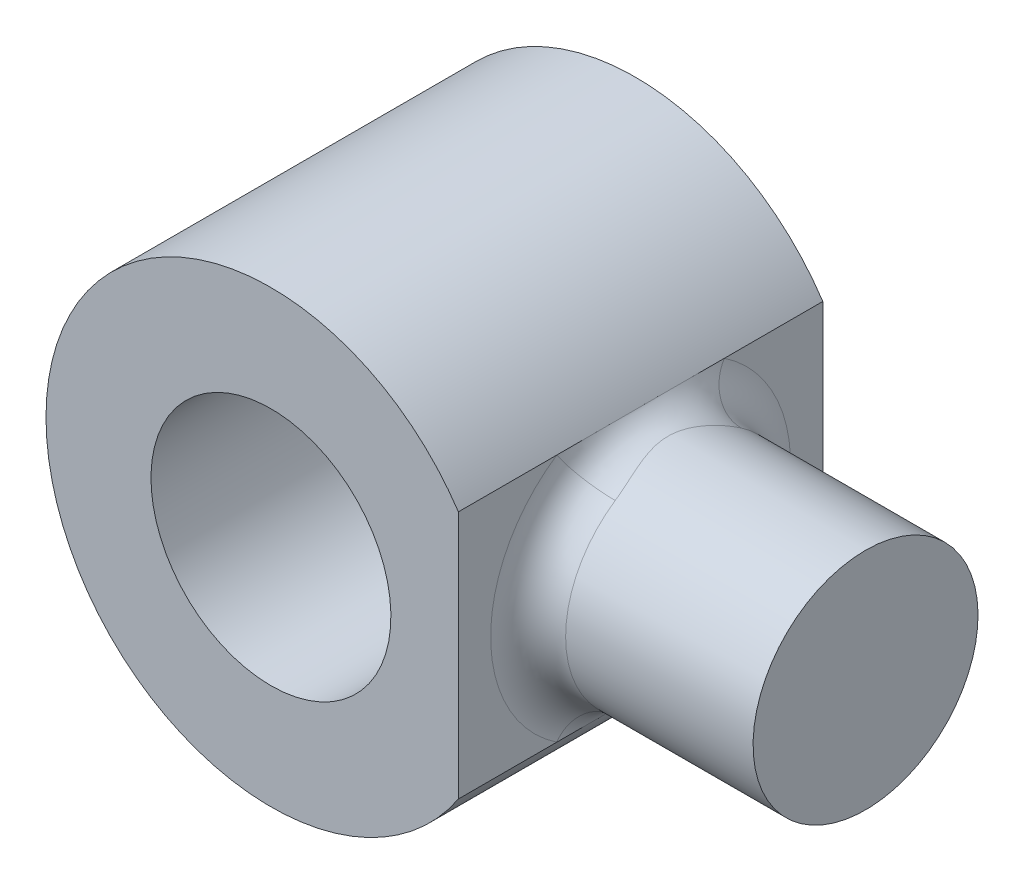
ISO-10303-21;
HEADER;
FILE_DESCRIPTION(('STEP AP214'),'2;1');
FILE_NAME('part.step','',(''),(''),'','','');
FILE_SCHEMA(('AUTOMOTIVE_DESIGN { 1 0 10303 214 1 1 1 1 }'));
ENDSEC;
DATA;
#1=APPLICATION_CONTEXT('core data for automotive mechanical design processes');
#2=APPLICATION_PROTOCOL_DEFINITION('international standard','automotive_design',2000,#1);
#3=PRODUCT_CONTEXT('',#1,'mechanical');
#4=PRODUCT('Part','Part','',(#3));
#5=PRODUCT_RELATED_PRODUCT_CATEGORY('part','',(#4));
#6=PRODUCT_DEFINITION_FORMATION('','',#4);
#7=PRODUCT_DEFINITION_CONTEXT('part definition',#1,'design');
#8=PRODUCT_DEFINITION('design','',#6,#7);
#9=PRODUCT_DEFINITION_SHAPE('','',#8);
#10=(LENGTH_UNIT() NAMED_UNIT(*) SI_UNIT(.MILLI.,.METRE.));
#11=(NAMED_UNIT(*) PLANE_ANGLE_UNIT() SI_UNIT($,.RADIAN.));
#12=(NAMED_UNIT(*) SI_UNIT($,.STERADIAN.) SOLID_ANGLE_UNIT());
#13=UNCERTAINTY_MEASURE_WITH_UNIT(LENGTH_MEASURE(1.E-05),#10,'distance_accuracy_value','');
#14=(GEOMETRIC_REPRESENTATION_CONTEXT(3) GLOBAL_UNCERTAINTY_ASSIGNED_CONTEXT((#13)) GLOBAL_UNIT_ASSIGNED_CONTEXT((#10,
#11,#12)) REPRESENTATION_CONTEXT('',''));
#15=CARTESIAN_POINT('',(0.,0.,0.));
#16=DIRECTION('',(0.,0.,1.));
#17=DIRECTION('',(1.,0.,0.));
#18=AXIS2_PLACEMENT_3D('',#15,#16,#17);
#19=CARTESIAN_POINT('',(15.04125,-1.5166876048223,-10.7694102980499));
#20=DIRECTION('',(1.,0.,0.));
#21=DIRECTION('',(0.,1.,0.));
#22=AXIS2_PLACEMENT_3D('',#19,#20,#21);
#23=PLANE('',#22);
#24=DIRECTION('',(0.,0.,1.));
#25=VECTOR('',#24,1.);
#26=CARTESIAN_POINT('',(15.04125,-1.5166876048223,-10.7694102980499));
#27=LINE('',#26,#25);
#28=CARTESIAN_POINT('',(15.04125,-1.5166876048223,-2.43));
#29=VERTEX_POINT('',#28);
#30=CARTESIAN_POINT('',(15.04125,-1.5166876048223,-1.1180339887499));
#31=VERTEX_POINT('',#30);
#32=EDGE_CURVE('E108',#29,#31,#27,.T.);
#33=ORIENTED_EDGE('',*,*,#32,.T.);
#34=CARTESIAN_POINT('',(15.04125,-3.175,0.));
#35=DIRECTION('',(1.,0.,0.));
#36=DIRECTION('',(0.,1.,0.));
#37=AXIS2_PLACEMENT_3D('',#34,#35,#36);
#38=CIRCLE('',#37,2.);
#39=CARTESIAN_POINT('',(15.04125,-4.8333123951777,-1.1180339887499));
#40=VERTEX_POINT('',#39);
#41=EDGE_CURVE('E12',#31,#40,#38,.F.);
#42=ORIENTED_EDGE('',*,*,#41,.T.);
#43=DIRECTION('',(0.,0.,1.));
#44=VECTOR('',#43,1.);
#45=CARTESIAN_POINT('',(15.04125,-4.8333123951777,-10.7694102980499));
#46=LINE('',#45,#44);
#47=CARTESIAN_POINT('',(15.04125,-4.8333123951777,-2.43));
#48=VERTEX_POINT('',#47);
#49=EDGE_CURVE('E106',#48,#40,#46,.T.);
#50=ORIENTED_EDGE('',*,*,#49,.F.);
#51=DIRECTION('',(0.,-1.,0.));
#52=VECTOR('',#51,1.);
#53=CARTESIAN_POINT('',(15.04125,-1.5166876048223,-2.43));
#54=LINE('',#53,#52);
#55=EDGE_CURVE('E122',#29,#48,#54,.T.);
#56=ORIENTED_EDGE('',*,*,#55,.F.);
#57=EDGE_LOOP('',(#33,#42,#50,#56));
#58=FACE_BOUND('',#57,.T.);
#59=ADVANCED_FACE('F38',(#58),#23,.T.);
#60=CARTESIAN_POINT('',(15.04125,-4.8333123951777,1.11803398874989));
#61=VERTEX_POINT('',#60);
#62=CARTESIAN_POINT('',(15.04125,-4.8333123951777,2.43));
#63=VERTEX_POINT('',#62);
#64=EDGE_CURVE('E59',#61,#63,#46,.T.);
#65=ORIENTED_EDGE('',*,*,#64,.F.);
#66=CARTESIAN_POINT('',(15.04125,-3.175,0.));
#67=DIRECTION('',(1.,0.,0.));
#68=DIRECTION('',(0.,1.,0.));
#69=AXIS2_PLACEMENT_3D('',#66,#67,#68);
#70=CIRCLE('',#69,2.);
#71=CARTESIAN_POINT('',(15.04125,-1.5166876048223,1.1180339887499));
#72=VERTEX_POINT('',#71);
#73=EDGE_CURVE('E51',#61,#72,#70,.F.);
#74=ORIENTED_EDGE('',*,*,#73,.T.);
#75=CARTESIAN_POINT('',(15.04125,-1.5166876048223,2.43));
#76=VERTEX_POINT('',#75);
#77=EDGE_CURVE('E95',#72,#76,#27,.T.);
#78=ORIENTED_EDGE('',*,*,#77,.T.);
#79=DIRECTION('',(0.,1.,0.));
#80=VECTOR('',#79,1.);
#81=CARTESIAN_POINT('',(15.04125,-1.5166876048223,2.43));
#82=LINE('',#81,#80);
#83=EDGE_CURVE('E99',#63,#76,#82,.T.);
#84=ORIENTED_EDGE('',*,*,#83,.F.);
#85=EDGE_LOOP('',(#65,#74,#78,#84));
#86=FACE_BOUND('',#85,.T.);
#87=ADVANCED_FACE('F97',(#86),#23,.T.);
#88=CARTESIAN_POINT('',(12.54125,-3.175,-10.7694102980499));
#89=DIRECTION('',(0.,0.,1.));
#90=DIRECTION('',(1.,0.,0.));
#91=AXIS2_PLACEMENT_3D('',#88,#89,#90);
#92=CYLINDRICAL_SURFACE('',#91,3.);
#93=CARTESIAN_POINT('',(12.54125,-3.175,-2.43));
#94=DIRECTION('',(0.,0.,1.));
#95=DIRECTION('',(0.,-1.,0.));
#96=AXIS2_PLACEMENT_3D('',#93,#94,#95);
#97=CIRCLE('',#96,3.);
#98=EDGE_CURVE('E125',#48,#29,#97,.F.);
#99=ORIENTED_EDGE('',*,*,#98,.F.);
#100=ORIENTED_EDGE('',*,*,#49,.T.);
#101=EDGE_CURVE('E128',#40,#61,#46,.T.);
#102=ORIENTED_EDGE('',*,*,#101,.T.);
#103=ORIENTED_EDGE('',*,*,#64,.T.);
#104=CARTESIAN_POINT('',(12.54125,-3.175,2.43));
#105=DIRECTION('',(0.,0.,1.));
#106=DIRECTION('',(0.,-1.,0.));
#107=AXIS2_PLACEMENT_3D('',#104,#105,#106);
#108=CIRCLE('',#107,3.);
#109=EDGE_CURVE('E109',#76,#63,#108,.T.);
#110=ORIENTED_EDGE('',*,*,#109,.F.);
#111=ORIENTED_EDGE('',*,*,#77,.F.);
#112=EDGE_CURVE('E105',#31,#72,#27,.T.);
#113=ORIENTED_EDGE('',*,*,#112,.F.);
#114=ORIENTED_EDGE('',*,*,#32,.F.);
#115=EDGE_LOOP('',(#99,#100,#102,#103,#110,#111,#113,#114));
#116=FACE_BOUND('',#115,.T.);
#117=ADVANCED_FACE('F111',(#116),#92,.T.);
#118=CARTESIAN_POINT('',(12.54125,-3.175,-10.7694102980499));
#119=DIRECTION('',(0.,0.,1.));
#120=DIRECTION('',(1.,0.,0.));
#121=AXIS2_PLACEMENT_3D('',#118,#119,#120);
#122=CYLINDRICAL_SURFACE('',#121,1.6);
#123=CARTESIAN_POINT('',(12.54125,-3.175,-2.43));
#124=DIRECTION('',(0.,0.,1.));
#125=DIRECTION('',(0.,-1.,0.));
#126=AXIS2_PLACEMENT_3D('',#123,#124,#125);
#127=CIRCLE('',#126,1.6);
#128=CARTESIAN_POINT('',(12.54125,-4.775,-2.43));
#129=VERTEX_POINT('',#128);
#130=EDGE_CURVE('E124',#129,#129,#127,.F.);
#131=ORIENTED_EDGE('',*,*,#130,.T.);
#132=EDGE_LOOP('',(#131));
#133=FACE_BOUND('',#132,.T.);
#134=CARTESIAN_POINT('',(12.54125,-3.175,2.43));
#135=DIRECTION('',(0.,0.,1.));
#136=DIRECTION('',(0.,-1.,0.));
#137=AXIS2_PLACEMENT_3D('',#134,#135,#136);
#138=CIRCLE('',#137,1.6);
#139=CARTESIAN_POINT('',(12.54125,-4.775,2.43));
#140=VERTEX_POINT('',#139);
#141=EDGE_CURVE('E115',#140,#140,#138,.T.);
#142=ORIENTED_EDGE('',*,*,#141,.T.);
#143=EDGE_LOOP('',(#142));
#144=FACE_BOUND('',#143,.T.);
#145=ADVANCED_FACE('F293',(#133,#144),#122,.F.);
#146=CARTESIAN_POINT('',(15.08125,-5.08,-2.43));
#147=DIRECTION('',(0.,0.,1.));
#148=DIRECTION('',(0.,-1.,0.));
#149=AXIS2_PLACEMENT_3D('',#146,#147,#148);
#150=PLANE('',#149);
#151=ORIENTED_EDGE('',*,*,#98,.T.);
#152=ORIENTED_EDGE('',*,*,#55,.T.);
#153=EDGE_LOOP('',(#151,#152));
#154=FACE_BOUND('',#153,.T.);
#155=ORIENTED_EDGE('',*,*,#130,.F.);
#156=EDGE_LOOP('',(#155));
#157=FACE_BOUND('',#156,.T.);
#158=ADVANCED_FACE('F285',(#154,#157),#150,.F.);
#159=CARTESIAN_POINT('',(15.08125,-5.08,2.43));
#160=DIRECTION('',(0.,0.,1.));
#161=DIRECTION('',(0.,-1.,0.));
#162=AXIS2_PLACEMENT_3D('',#159,#160,#161);
#163=PLANE('',#162);
#164=ORIENTED_EDGE('',*,*,#141,.F.);
#165=EDGE_LOOP('',(#164));
#166=FACE_BOUND('',#165,.T.);
#167=ORIENTED_EDGE('',*,*,#83,.T.);
#168=ORIENTED_EDGE('',*,*,#109,.T.);
#169=EDGE_LOOP('',(#167,#168));
#170=FACE_BOUND('',#169,.T.);
#171=ADVANCED_FACE('F114',(#166,#170),#163,.T.);
#172=CARTESIAN_POINT('',(18.04125,-3.175,0.));
#173=DIRECTION('',(-1.,0.,0.));
#174=DIRECTION('',(0.,-1.,0.));
#175=AXIS2_PLACEMENT_3D('',#172,#173,#174);
#176=CYLINDRICAL_SURFACE('',#175,1.5);
#177=CARTESIAN_POINT('',(15.54125,-3.175,0.));
#178=DIRECTION('',(1.,0.,0.));
#179=DIRECTION('',(0.,1.,0.));
#180=AXIS2_PLACEMENT_3D('',#177,#178,#179);
#181=CIRCLE('',#180,1.5);
#182=CARTESIAN_POINT('',(15.54125,-4.41873429638327,-0.838525491562421));
#183=VERTEX_POINT('',#182);
#184=CARTESIAN_POINT('',(15.54125,-1.93126570361672,-0.838525491562422));
#185=VERTEX_POINT('',#184);
#186=EDGE_CURVE('E131',#183,#185,#181,.T.);
#187=ORIENTED_EDGE('',*,*,#186,.T.);
#188=CARTESIAN_POINT('',(15.4979254592864,-2.08395569264064,-1.02937957983376));
#189=CARTESIAN_POINT('',(14.8490887357678,-1.94773420205476,-0.884997774758777));
#190=CARTESIAN_POINT('',(15.04125,-1.5166876048223,-1.37250610644502));
#191=CARTESIAN_POINT('',(15.512805432516,-2.05873171344061,-1.00270724504204));
#192=CARTESIAN_POINT('',(14.8811216244461,-1.96004411983348,-0.891297479389579));
#193=CARTESIAN_POINT('',(15.04125,-1.5166876048223,-1.33694299338939));
#194=CARTESIAN_POINT('',(15.5231862320718,-2.03403159441908,-0.974503879520466));
#195=CARTESIAN_POINT('',(14.9141873327958,-1.96328427161882,-0.890581445259312));
#196=CARTESIAN_POINT('',(15.04125,-1.5166876048223,-1.29933850602729));
#197=CARTESIAN_POINT('',(15.5368283947724,-1.98664996735781,-0.916071865941035));
#198=CARTESIAN_POINT('',(14.9752669529482,-1.95741892619237,-0.876988160290842));
#199=CARTESIAN_POINT('',(15.04125,-1.5166876048223,-1.22142915458805));
#200=CARTESIAN_POINT('',(15.5401732739348,-1.96394788054697,-0.885871416551931));
#201=CARTESIAN_POINT('',(15.0035910595531,-1.94908558780062,-0.864872243336415));
#202=CARTESIAN_POINT('',(15.04125,-1.5166876048223,-1.18116188873591));
#203=CARTESIAN_POINT('',(15.5424260666067,-1.90725768083533,-0.804147671302249));
#204=CARTESIAN_POINT('',(15.0672936606381,-1.91964651507155,-0.821349713036026));
#205=CARTESIAN_POINT('',(15.04125,-1.5166876048223,-1.07219689506967));
#206=CARTESIAN_POINT('',(15.5371786970004,-1.87523493655006,-0.751240549245426));
#207=CARTESIAN_POINT('',(15.0988045220343,-1.89386032563239,-0.782746082139181));
#208=CARTESIAN_POINT('',(15.04125,-1.5166876048223,-1.00165406566057));
#209=CARTESIAN_POINT('',(15.519504422639,-1.81797695052088,-0.642128532485644));
#210=CARTESIAN_POINT('',(15.1446396864565,-1.84150684564184,-0.690767129722053));
#211=CARTESIAN_POINT('',(15.04125,-1.5166876048223,-0.856171376647526));
#212=CARTESIAN_POINT('',(15.5070187181356,-1.79279980862356,-0.585900057544083));
#213=CARTESIAN_POINT('',(15.1601172750333,-1.81462975075928,-0.637508889676387));
#214=CARTESIAN_POINT('',(15.04125,-1.5166876048223,-0.781200076725444));
#215=CARTESIAN_POINT('',(15.4786104929916,-1.74769974356931,-0.466115421759557));
#216=CARTESIAN_POINT('',(15.1809272797797,-1.76464893991281,-0.517762558466147));
#217=CARTESIAN_POINT('',(15.04125,-1.5166876048223,-0.621487229012742));
#218=CARTESIAN_POINT('',(15.4624839451491,-1.72842092658806,-0.402346440725287));
#219=CARTESIAN_POINT('',(15.1860177850463,-1.74130265657822,-0.449802650654516));
#220=CARTESIAN_POINT('',(15.04125,-1.5166876048223,-0.536461920967049));
#221=CARTESIAN_POINT('',(15.43404378114,-1.69849107481471,-0.272603088522837));
#222=CARTESIAN_POINT('',(15.1906094061083,-1.70490329635629,-0.308472992803358));
#223=CARTESIAN_POINT('',(15.04125,-1.5166876048223,-0.363470784697116));
#224=CARTESIAN_POINT('',(15.4217103409141,-1.68779469584388,-0.206642251426395));
#225=CARTESIAN_POINT('',(15.1903290925537,-1.691235952526,-0.234210124180577));
#226=CARTESIAN_POINT('',(15.04125,-1.5166876048223,-0.275523001901859));
#227=CARTESIAN_POINT('',(15.4105024002669,-1.67839201194449,-0.106336693274796));
#228=CARTESIAN_POINT('',(15.1897799599436,-1.67931386612658,-0.120747980904317));
#229=CARTESIAN_POINT('',(15.04125,-1.5166876048223,-0.141782257699727));
#230=CARTESIAN_POINT('',(15.4079870469544,-1.67637073827254,-0.0725224795522463));
#231=CARTESIAN_POINT('',(15.1895743678026,-1.67674003303612,-0.0823422855445681));
#232=CARTESIAN_POINT('',(15.04125,-1.5166876048223,-0.0966966394029949));
#233=CARTESIAN_POINT('',(15.4058212653963,-1.67462539605145,-0.00478090932853701));
#234=CARTESIAN_POINT('',(15.1894027288159,-1.67452716310194,-0.00546975587427077));
#235=CARTESIAN_POINT('',(15.04125,-1.5166876048223,-0.00637454577138279));
#236=CARTESIAN_POINT('',(15.4061704867494,-1.67490104653735,0.0291464328270074));
#237=CARTESIAN_POINT('',(15.1894358997041,-1.67487830804166,0.0331606383849827));
#238=CARTESIAN_POINT('',(15.04125,-1.5166876048223,0.0388619104360097));
#239=CARTESIAN_POINT('',(15.409688714396,-1.67774933983996,0.0969301693897144));
#240=CARTESIAN_POINT('',(15.1897029482135,-1.67849187825828,0.110016587677958));
#241=CARTESIAN_POINT('',(15.04125,-1.5166876048223,0.129240225852952));
#242=CARTESIAN_POINT('',(15.4128670966642,-1.68032962040831,0.130785952381216));
#243=CARTESIAN_POINT('',(15.1899386017292,-1.68177950793663,0.148403824930138));
#244=CARTESIAN_POINT('',(15.04125,-1.5166876048223,0.17438126984162));
#245=CARTESIAN_POINT('',(15.4215417088095,-1.68775144010596,0.19809007298592));
#246=CARTESIAN_POINT('',(15.1902262527721,-1.69112029791909,0.224132720549648));
#247=CARTESIAN_POINT('',(15.04125,-1.5166876048223,0.264120097314559));
#248=CARTESIAN_POINT('',(15.4270394077628,-1.69259441265426,0.231538138507008));
#249=CARTESIAN_POINT('',(15.1902774580528,-1.69721431234615,0.261626611631459));
#250=CARTESIAN_POINT('',(15.04125,-1.5166876048223,0.308717518009344));
#251=CARTESIAN_POINT('',(15.4411497484602,-1.70596720144719,0.30612471028694));
#252=CARTESIAN_POINT('',(15.1894813199561,-1.7138042436513,0.344374539470131));
#253=CARTESIAN_POINT('',(15.04125,-1.5166876048223,0.408166280382587));
#254=CARTESIAN_POINT('',(15.4501970352288,-1.71511439211366,0.347106992756403));
#255=CARTESIAN_POINT('',(15.1883895844004,-1.72509527118255,0.389334800004552));
#256=CARTESIAN_POINT('',(15.04125,-1.5166876048223,0.462809323675204));
#257=CARTESIAN_POINT('',(15.4690811413881,-1.73676048716886,0.428051565103764));
#258=CARTESIAN_POINT('',(15.1835482164642,-1.75095789723702,0.476117222352398));
#259=CARTESIAN_POINT('',(15.04125,-1.5166876048223,0.57073542013835));
#260=CARTESIAN_POINT('',(15.4789183303935,-1.74926096712409,0.4680133658097));
#261=CARTESIAN_POINT('',(15.179725193538,-1.76568369515797,0.518148621539786));
#262=CARTESIAN_POINT('',(15.04125,-1.5166876048223,0.624017821079598));
#263=CARTESIAN_POINT('',(15.5072858108045,-1.79175764027848,0.586189786534188));
#264=CARTESIAN_POINT('',(15.1613170077763,-1.81432817390297,0.639698373447864));
#265=CARTESIAN_POINT('',(15.04125,-1.5166876048223,0.78158638204559));
#266=CARTESIAN_POINT('',(15.5247324502581,-1.82679019462276,0.6629246767571));
#267=CARTESIAN_POINT('',(15.1392312871527,-1.85255897658205,0.712429487004927));
#268=CARTESIAN_POINT('',(15.04125,-1.5166876048223,0.883899569009491));
#269=CARTESIAN_POINT('',(15.538495695157,-1.88744626706839,0.770538422105004));
#270=CARTESIAN_POINT('',(15.0869006450246,-1.90237958342454,0.795167744193887));
#271=CARTESIAN_POINT('',(15.04125,-1.5166876048223,1.02738456280669));
#272=CARTESIAN_POINT('',(15.5411314157026,-1.90798005980562,0.803862019158754));
#273=CARTESIAN_POINT('',(15.0663382107235,-1.91781494410187,0.818577631929177));
#274=CARTESIAN_POINT('',(15.04125,-1.5166876048223,1.07181602554501));
#275=CARTESIAN_POINT('',(15.5413605028959,-1.95153582591629,0.868707536519792));
#276=CARTESIAN_POINT('',(15.0183337551284,-1.94356596275838,0.856765316462372));
#277=CARTESIAN_POINT('',(15.04125,-1.5166876048223,1.15827671535972));
#278=CARTESIAN_POINT('',(15.5389756935863,-1.97454661919947,0.900236645382412));
#279=CARTESIAN_POINT('',(14.9904626780305,-1.95370806297092,0.871238087056668));
#280=CARTESIAN_POINT('',(15.04125,-1.5166876048223,1.20031552717655));
#281=CARTESIAN_POINT('',(15.5281941924343,-2.01886157364849,0.956242831692893));
#282=CARTESIAN_POINT('',(14.9341934419429,-1.96251561083303,0.88737124193201));
#283=CARTESIAN_POINT('',(15.04125,-1.5166876048223,1.27499044225719));
#284=CARTESIAN_POINT('',(15.5207976662976,-2.03986850705279,0.98105095897901));
#285=CARTESIAN_POINT('',(14.9061008051066,-1.96236407371098,0.890324403793481));
#286=CARTESIAN_POINT('',(15.04125,-1.5166876048223,1.30806794530535));
#287=CARTESIAN_POINT('',(15.4996250047353,-2.08279605927602,1.02866982593576));
#288=CARTESIAN_POINT('',(14.8496788740828,-1.95035774933632,0.886972120693864));
#289=CARTESIAN_POINT('',(15.04125,-1.5166876048223,1.37155976791435));
#290=CARTESIAN_POINT('',(15.4857850723334,-2.10472377261747,1.05145781420652));
#291=CARTESIAN_POINT('',(14.8214013681335,-1.93776243944499,0.88007353384156));
#292=CARTESIAN_POINT('',(15.04125,-1.5166876048223,1.40194375227536));
#293=CARTESIAN_POINT('',(15.4680515211128,-2.12661221532451,1.07279217602629));
#294=CARTESIAN_POINT('',(14.796888213592,-1.91710676727242,0.868052658467213));
#295=CARTESIAN_POINT('',(15.04125,-1.5166876048223,1.43038956803505));
#296=(BOUNDED_SURFACE() B_SPLINE_SURFACE(3,2,((#188,#189,#190),(#191,#192,#193),(#194,#195,
#196),(#197,#198,#199),(#200,#201,#202),(#203,#204,#205),(#206,#207,#208),(#209,#210,#211),
(#212,#213,#214),(#215,#216,#217),(#218,#219,#220),(#221,#222,#223),(#224,#225,#226),(#227,#228,
#229),(#230,#231,#232),(#233,#234,#235),(#236,#237,#238),(#239,#240,#241),(#242,#243,#244),
(#245,#246,#247),(#248,#249,#250),(#251,#252,#253),(#254,#255,#256),(#257,#258,#259),(#260,#261,
#262),(#263,#264,#265),(#266,#267,#268),(#269,#270,#271),(#272,#273,#274),(#275,#276,#277),
(#278,#279,#280),(#281,#282,#283),(#284,#285,#286),(#287,#288,#289),(#290,#291,#292),(#293,#294,
#295)),.UNSPECIFIED.,.F.,.F.,.F.) B_SPLINE_SURFACE_WITH_KNOTS((4,2,2,2,2,2,2,2,2,2,2,2,2,2,2,2,
2,4),(3,3),(0.,0.15273217851942,0.303640959960972,0.550186825054283,0.798764112075068,
1.06887525854553,1.33754973395404,1.47308349712335,1.60860068173985,1.74456865582133,
1.88062288286981,2.05051405502948,2.22048519199083,2.55948738436505,2.71596475972599,
2.87176333900653,3.00315876912052,3.13588376999515),(0.,1.),
.UNSPECIFIED.) GEOMETRIC_REPRESENTATION_ITEM() RATIONAL_B_SPLINE_SURFACE(((1.,0.593227298903359,
1.),(1.,0.610969190278355,1.),(1.,0.628958732798297,1.),(1.,0.664312042750394,1.),(1.,
0.68168071699393,1.),(1.,0.725739348230159,1.),(1.,0.751360844231366,1.),(1.,0.797788353995855,
1.),(1.,0.818552951011775,1.),(1.,0.856027722541012,1.),(1.,0.872230841214212,1.),(1.,
0.897478197988189,1.),(1.,0.90656005446344,1.),(1.,0.914549889350528,1.),(1.,0.91626929930185,
1.),(1.,0.917753906884282,1.),(1.,0.917519343529823,1.),(1.,0.915096681215387,1.),(1.,
0.91290208653651,1.),(1.,0.906599885295358,1.),(1.,0.902491066073459,1.),(1.,0.89117124295856,
1.),(1.,0.883442861136925,1.),(1.,0.865241470087529,1.),(1.,0.85476717072384,1.),(1.,
0.819366364887491,1.),(1.,0.790426340638363,1.),(1.,0.741665560365587,1.),(1.,0.725324359661808,
1.),(1.,0.69124744127008,1.),(1.,0.673518080482277,1.),(1.,0.640194460410711,1.),(1.,
0.624700742988319,1.),(1.,0.593894485825256,1.),(1.,0.578585365813956,1.),(1.,0.56387634842054,1.))) REPRESENTATION_ITEM('') SURFACE());
#297=CARTESIAN_POINT('',(15.4979254592864,-2.08395569264064,-1.02937957983376));
#298=CARTESIAN_POINT('',(15.512805432516,-2.05873171344061,-1.00270724504204));
#299=CARTESIAN_POINT('',(15.5231862320718,-2.03403159441908,-0.974503879520466));
#300=CARTESIAN_POINT('',(15.5368283947724,-1.98664996735781,-0.916071865941035));
#301=CARTESIAN_POINT('',(15.5401732739348,-1.96394788054697,-0.885871416551931));
#302=CARTESIAN_POINT('',(15.5424260666067,-1.90725768083533,-0.804147671302249));
#303=CARTESIAN_POINT('',(15.5371786970004,-1.87523493655006,-0.751240549245426));
#304=CARTESIAN_POINT('',(15.519504422639,-1.81797695052088,-0.642128532485644));
#305=CARTESIAN_POINT('',(15.5070187181356,-1.79279980862356,-0.585900057544083));
#306=CARTESIAN_POINT('',(15.4786104929916,-1.74769974356931,-0.466115421759557));
#307=CARTESIAN_POINT('',(15.4624839451491,-1.72842092658806,-0.402346440725287));
#308=CARTESIAN_POINT('',(15.43404378114,-1.69849107481471,-0.272603088522837));
#309=CARTESIAN_POINT('',(15.4217103409141,-1.68779469584388,-0.206642251426395));
#310=CARTESIAN_POINT('',(15.4105024002669,-1.67839201194449,-0.106336693274796));
#311=CARTESIAN_POINT('',(15.4079870469544,-1.67637073827254,-0.0725224795522463));
#312=CARTESIAN_POINT('',(15.4058212653963,-1.67462539605145,-0.00478090932853699));
#313=CARTESIAN_POINT('',(15.4061704867494,-1.67490104653735,0.0291464328270074));
#314=CARTESIAN_POINT('',(15.409688714396,-1.67774933983996,0.0969301693897144));
#315=CARTESIAN_POINT('',(15.4128670966642,-1.68032962040831,0.130785952381216));
#316=CARTESIAN_POINT('',(15.4215417088095,-1.68775144010596,0.19809007298592));
#317=CARTESIAN_POINT('',(15.4270394077628,-1.69259441265426,0.231538138507008));
#318=CARTESIAN_POINT('',(15.4411497484602,-1.70596720144719,0.30612471028694));
#319=CARTESIAN_POINT('',(15.4501970352288,-1.71511439211366,0.347106992756403));
#320=CARTESIAN_POINT('',(15.4690811413881,-1.73676048716886,0.428051565103764));
#321=CARTESIAN_POINT('',(15.4789183303935,-1.74926096712409,0.4680133658097));
#322=CARTESIAN_POINT('',(15.5072858108045,-1.79175764027848,0.586189786534188));
#323=CARTESIAN_POINT('',(15.5247324502581,-1.82679019462276,0.6629246767571));
#324=CARTESIAN_POINT('',(15.538495695157,-1.88744626706839,0.770538422105004));
#325=CARTESIAN_POINT('',(15.5411314157026,-1.90798005980562,0.803862019158754));
#326=CARTESIAN_POINT('',(15.5413605028959,-1.95153582591629,0.868707536519792));
#327=CARTESIAN_POINT('',(15.5389756935863,-1.97454661919947,0.900236645382412));
#328=CARTESIAN_POINT('',(15.5281941924343,-2.01886157364849,0.956242831692893));
#329=CARTESIAN_POINT('',(15.5207976662976,-2.03986850705279,0.98105095897901));
#330=CARTESIAN_POINT('',(15.4996250047353,-2.08279605927602,1.02866982593576));
#331=CARTESIAN_POINT('',(15.4857850723334,-2.10472377261747,1.05145781420652));
#332=CARTESIAN_POINT('',(15.4680515211128,-2.12661221532451,1.07279217602629));
#333=B_SPLINE_CURVE_WITH_KNOTS('',3,(#297,#298,#299,#300,#301,#302,#303,#304,#305,#306,#307,
#308,#309,#310,#311,#312,#313,#314,#315,#316,#317,#318,#319,#320,#321,#322,#323,#324,#325,#326,
#327,#328,#329,#330,#331,#332),.UNSPECIFIED.,.F.,.F.,(4,2,2,2,2,2,2,2,2,2,2,2,2,2,2,2,2,4),(0.,
0.15273217851942,0.303640959960972,0.550186825054283,0.798764112075068,1.06887525854553,
1.33754973395404,1.47308349712335,1.60860068173985,1.74456865582133,1.88062288286981,
2.05051405502948,2.22048519199083,2.55948738436505,2.71596475972599,2.87176333900653,
3.00315876912052,3.13588376999515),.UNSPECIFIED.);
#334=CARTESIAN_POINT('',(15.54125,-1.93126570361672,0.838525491562422));
#335=VERTEX_POINT('',#334);
#336=EDGE_CURVE('E214',#185,#335,#333,.T.);
#337=ORIENTED_EDGE('',*,*,#336,.T.);
#338=CARTESIAN_POINT('',(15.54125,-3.175,0.));
#339=DIRECTION('',(1.,0.,0.));
#340=DIRECTION('',(0.,1.,0.));
#341=AXIS2_PLACEMENT_3D('',#338,#339,#340);
#342=CIRCLE('',#341,1.5);
#343=CARTESIAN_POINT('',(15.54125,-4.41873429638327,0.838525491562421));
#344=VERTEX_POINT('',#343);
#345=EDGE_CURVE('E141',#335,#344,#342,.T.);
#346=ORIENTED_EDGE('',*,*,#345,.T.);
#347=CARTESIAN_POINT('',(15.4979254592864,-4.26604430735936,1.02937957983376));
#348=CARTESIAN_POINT('',(14.8490887357678,-4.40226579794524,0.884997774758775));
#349=CARTESIAN_POINT('',(15.04125,-4.8333123951777,1.37250610644501));
#350=CARTESIAN_POINT('',(15.512805432516,-4.29126828655939,1.00270724504204));
#351=CARTESIAN_POINT('',(14.881121624446,-4.38995588016652,0.891297479389577));
#352=CARTESIAN_POINT('',(15.04125,-4.8333123951777,1.33694299338939));
#353=CARTESIAN_POINT('',(15.5231862320718,-4.31596840558092,0.974503879520465));
#354=CARTESIAN_POINT('',(14.9141873327958,-4.38671572838118,0.89058144525931));
#355=CARTESIAN_POINT('',(15.04125,-4.8333123951777,1.29933850602729));
#356=CARTESIAN_POINT('',(15.5368283947724,-4.36335003264219,0.916071865941034));
#357=CARTESIAN_POINT('',(14.9752669529482,-4.39258107380763,0.876988160290841));
#358=CARTESIAN_POINT('',(15.04125,-4.8333123951777,1.22142915458804));
#359=CARTESIAN_POINT('',(15.5401732739348,-4.38605211945303,0.88587141655193));
#360=CARTESIAN_POINT('',(15.0035910595531,-4.40091441219938,0.864872243336413));
#361=CARTESIAN_POINT('',(15.04125,-4.8333123951777,1.18116188873591));
#362=CARTESIAN_POINT('',(15.5424260666067,-4.44274231916467,0.804147671302248));
#363=CARTESIAN_POINT('',(15.0672936606381,-4.43035348492845,0.821349713036024));
#364=CARTESIAN_POINT('',(15.04125,-4.8333123951777,1.07219689506966));
#365=CARTESIAN_POINT('',(15.5371786970004,-4.47476506344995,0.751240549245424));
#366=CARTESIAN_POINT('',(15.0988045220343,-4.45613967436761,0.782746082139179));
#367=CARTESIAN_POINT('',(15.04125,-4.8333123951777,1.00165406566057));
#368=CARTESIAN_POINT('',(15.519504422639,-4.53202304947912,0.642128532485643));
#369=CARTESIAN_POINT('',(15.1446396864565,-4.50849315435816,0.69076712972205));
#370=CARTESIAN_POINT('',(15.04125,-4.8333123951777,0.856171376647523));
#371=CARTESIAN_POINT('',(15.5070187181356,-4.55720019137644,0.585900057544082));
#372=CARTESIAN_POINT('',(15.1601172750333,-4.53537024924073,0.637508889676386));
#373=CARTESIAN_POINT('',(15.04125,-4.8333123951777,0.781200076725443));
#374=CARTESIAN_POINT('',(15.4786104929916,-4.60230025643069,0.466115421759556));
#375=CARTESIAN_POINT('',(15.1809272797797,-4.58535106008719,0.517762558466147));
#376=CARTESIAN_POINT('',(15.04125,-4.8333123951777,0.621487229012742));
#377=CARTESIAN_POINT('',(15.4624839451491,-4.62157907341194,0.402346440725286));
#378=CARTESIAN_POINT('',(15.1860177850463,-4.60869734342177,0.449802650654516));
#379=CARTESIAN_POINT('',(15.04125,-4.8333123951777,0.536461920967049));
#380=CARTESIAN_POINT('',(15.43404378114,-4.65150892518529,0.272603088522836));
#381=CARTESIAN_POINT('',(15.1906094061083,-4.64509670364371,0.308472992803357));
#382=CARTESIAN_POINT('',(15.04125,-4.8333123951777,0.363470784697116));
#383=CARTESIAN_POINT('',(15.4217103409141,-4.66220530415612,0.206642251426394));
#384=CARTESIAN_POINT('',(15.1903290925537,-4.658764047474,0.234210124180577));
#385=CARTESIAN_POINT('',(15.04125,-4.8333123951777,0.275523001901859));
#386=CARTESIAN_POINT('',(15.4105024002669,-4.67160798805551,0.106336693274795));
#387=CARTESIAN_POINT('',(15.1897799599436,-4.67068613387342,0.120747980904317));
#388=CARTESIAN_POINT('',(15.04125,-4.8333123951777,0.141782257699727));
#389=CARTESIAN_POINT('',(15.4079870469544,-4.67362926172746,0.0725224795522456));
#390=CARTESIAN_POINT('',(15.1895743678026,-4.67325996696388,0.082342285544567));
#391=CARTESIAN_POINT('',(15.04125,-4.8333123951777,0.0966966394029934));
#392=CARTESIAN_POINT('',(15.4058212653963,-4.67537460394855,0.00478090932853596));
#393=CARTESIAN_POINT('',(15.1894027288159,-4.67547283689806,0.00546975587426929));
#394=CARTESIAN_POINT('',(15.04125,-4.8333123951777,0.00637454577138098));
#395=CARTESIAN_POINT('',(15.4061704867494,-4.67509895346265,-0.0291464328270086));
#396=CARTESIAN_POINT('',(15.1894358997041,-4.67512169195834,-0.0331606383849839));
#397=CARTESIAN_POINT('',(15.04125,-4.8333123951777,-0.0388619104360111));
#398=CARTESIAN_POINT('',(15.409688714396,-4.67225066016004,-0.0969301693897157));
#399=CARTESIAN_POINT('',(15.1897029482135,-4.67150812174172,-0.11001658767796));
#400=CARTESIAN_POINT('',(15.04125,-4.8333123951777,-0.129240225852954));
#401=CARTESIAN_POINT('',(15.4128670966642,-4.66967037959168,-0.130785952381217));
#402=CARTESIAN_POINT('',(15.1899386017292,-4.66822049206336,-0.14840382493014));
#403=CARTESIAN_POINT('',(15.04125,-4.8333123951777,-0.174381269841623));
#404=CARTESIAN_POINT('',(15.4215417088095,-4.66224855989404,-0.198090072985921));
#405=CARTESIAN_POINT('',(15.1902262527721,-4.65887970208091,-0.224132720549651));
#406=CARTESIAN_POINT('',(15.04125,-4.8333123951777,-0.264120097314562));
#407=CARTESIAN_POINT('',(15.4270394077628,-4.65740558734574,-0.23153813850701));
#408=CARTESIAN_POINT('',(15.1902774580528,-4.65278568765384,-0.261626611631461));
#409=CARTESIAN_POINT('',(15.04125,-4.8333123951777,-0.308717518009347));
#410=CARTESIAN_POINT('',(15.4411497484602,-4.64403279855281,-0.306124710286942));
#411=CARTESIAN_POINT('',(15.1894813199561,-4.6361957563487,-0.344374539470133));
#412=CARTESIAN_POINT('',(15.04125,-4.8333123951777,-0.408166280382588));
#413=CARTESIAN_POINT('',(15.4501970352288,-4.63488560788634,-0.347106992756406));
#414=CARTESIAN_POINT('',(15.1883895844004,-4.62490472881745,-0.389334800004554));
#415=CARTESIAN_POINT('',(15.04125,-4.8333123951777,-0.462809323675207));
#416=CARTESIAN_POINT('',(15.4690811413881,-4.61323951283114,-0.428051565103766));
#417=CARTESIAN_POINT('',(15.1835482164642,-4.59904210276298,-0.476117222352401));
#418=CARTESIAN_POINT('',(15.04125,-4.8333123951777,-0.570735420138354));
#419=CARTESIAN_POINT('',(15.4789183303935,-4.60073903287591,-0.468013365809702));
#420=CARTESIAN_POINT('',(15.179725193538,-4.58431630484203,-0.518148621539789));
#421=CARTESIAN_POINT('',(15.04125,-4.8333123951777,-0.624017821079602));
#422=CARTESIAN_POINT('',(15.5072858108045,-4.55824235972151,-0.586189786534191));
#423=CARTESIAN_POINT('',(15.1613170077763,-4.53567182609703,-0.639698373447866));
#424=CARTESIAN_POINT('',(15.04125,-4.8333123951777,-0.781586382045593));
#425=CARTESIAN_POINT('',(15.5247324502581,-4.52320980537723,-0.662924676757103));
#426=CARTESIAN_POINT('',(15.1392312871527,-4.49744102341795,-0.712429487004929));
#427=CARTESIAN_POINT('',(15.04125,-4.8333123951777,-0.883899569009494));
#428=CARTESIAN_POINT('',(15.538495695157,-4.46255373293161,-0.770538422105007));
#429=CARTESIAN_POINT('',(15.0869006450246,-4.44762041657546,-0.795167744193888));
#430=CARTESIAN_POINT('',(15.04125,-4.8333123951777,-1.02738456280669));
#431=CARTESIAN_POINT('',(15.5411314157026,-4.44201994019438,-0.803862019158756));
#432=CARTESIAN_POINT('',(15.0663382107235,-4.43218505589812,-0.818577631929179));
#433=CARTESIAN_POINT('',(15.04125,-4.8333123951777,-1.07181602554501));
#434=CARTESIAN_POINT('',(15.5413605028959,-4.39846417408371,-0.868707536519794));
#435=CARTESIAN_POINT('',(15.0183337551284,-4.40643403724162,-0.856765316462373));
#436=CARTESIAN_POINT('',(15.04125,-4.8333123951777,-1.15827671535972));
#437=CARTESIAN_POINT('',(15.5389756935863,-4.37545338080053,-0.900236645382414));
#438=CARTESIAN_POINT('',(14.9904626780305,-4.39629193702908,-0.871238087056668));
#439=CARTESIAN_POINT('',(15.04125,-4.8333123951777,-1.20031552717655));
#440=CARTESIAN_POINT('',(15.5281941924343,-4.33113842635151,-0.956242831692894));
#441=CARTESIAN_POINT('',(14.9341934419429,-4.38748438916697,-0.887371241932009));
#442=CARTESIAN_POINT('',(15.04125,-4.8333123951777,-1.27499044225719));
#443=CARTESIAN_POINT('',(15.5207976662976,-4.31013149294721,-0.98105095897901));
#444=CARTESIAN_POINT('',(14.9061008051066,-4.38763592628902,-0.89032440379348));
#445=CARTESIAN_POINT('',(15.04125,-4.8333123951777,-1.30806794530535));
#446=CARTESIAN_POINT('',(15.4996250047353,-4.26720394072398,-1.02866982593576));
#447=CARTESIAN_POINT('',(14.8496788740828,-4.39964225066368,-0.886972120693863));
#448=CARTESIAN_POINT('',(15.04125,-4.8333123951777,-1.37155976791435));
#449=CARTESIAN_POINT('',(15.4857850723334,-4.24527622738253,-1.05145781420652));
#450=CARTESIAN_POINT('',(14.8214013681335,-4.41223756055501,-0.880073533841559));
#451=CARTESIAN_POINT('',(15.04125,-4.8333123951777,-1.40194375227536));
#452=CARTESIAN_POINT('',(15.4680515211128,-4.22338778467549,-1.07279217602629));
#453=CARTESIAN_POINT('',(14.796888213592,-4.43289323272758,-0.868052658467212));
#454=CARTESIAN_POINT('',(15.04125,-4.8333123951777,-1.43038956803505));
#455=(BOUNDED_SURFACE() B_SPLINE_SURFACE(3,2,((#347,#348,#349),(#350,#351,#352),(#353,#354,
#355),(#356,#357,#358),(#359,#360,#361),(#362,#363,#364),(#365,#366,#367),(#368,#369,#370),
(#371,#372,#373),(#374,#375,#376),(#377,#378,#379),(#380,#381,#382),(#383,#384,#385),(#386,#387,
#388),(#389,#390,#391),(#392,#393,#394),(#395,#396,#397),(#398,#399,#400),(#401,#402,#403),
(#404,#405,#406),(#407,#408,#409),(#410,#411,#412),(#413,#414,#415),(#416,#417,#418),(#419,#420,
#421),(#422,#423,#424),(#425,#426,#427),(#428,#429,#430),(#431,#432,#433),(#434,#435,#436),
(#437,#438,#439),(#440,#441,#442),(#443,#444,#445),(#446,#447,#448),(#449,#450,#451),(#452,#453,
#454)),.UNSPECIFIED.,.F.,.F.,.F.) B_SPLINE_SURFACE_WITH_KNOTS((4,2,2,2,2,2,2,2,2,2,2,2,2,2,2,2,
2,4),(3,3),(0.,0.152732178519421,0.303640959960973,0.550186825054283,0.798764112075067,
1.06887525854553,1.33754973395403,1.47308349712335,1.60860068173985,1.74456865582133,
1.88062288286981,2.05051405502948,2.22048519199083,2.55948738436506,2.71596475972599,
2.87176333900653,3.00315876912052,3.13588376999515),(0.,1.),
.UNSPECIFIED.) GEOMETRIC_REPRESENTATION_ITEM() RATIONAL_B_SPLINE_SURFACE(((1.,0.593227298903359,
1.),(1.,0.610969190278355,1.),(1.,0.628958732798297,1.),(1.,0.664312042750394,1.),(1.,
0.681680716993929,1.),(1.,0.725739348230159,1.),(1.,0.751360844231367,1.),(1.,0.797788353995855,
1.),(1.,0.818552951011775,1.),(1.,0.856027722541011,1.),(1.,0.872230841214211,1.),(1.,
0.897478197988188,1.),(1.,0.906560054463439,1.),(1.,0.914549889350528,1.),(1.,0.916269299301849,
1.),(1.,0.917753906884281,1.),(1.,0.917519343529822,1.),(1.,0.915096681215386,1.),(1.,
0.912902086536509,1.),(1.,0.906599885295357,1.),(1.,0.902491066073458,1.),(1.,0.891171242958559,
1.),(1.,0.883442861136924,1.),(1.,0.865241470087528,1.),(1.,0.854767170723838,1.),(1.,
0.819366364887489,1.),(1.,0.790426340638361,1.),(1.,0.741665560365585,1.),(1.,0.725324359661806,
1.),(1.,0.691247441270078,1.),(1.,0.673518080482276,1.),(1.,0.64019446041071,1.),(1.,
0.624700742988319,1.),(1.,0.593894485825256,1.),(1.,0.578585365813955,1.),(1.,0.56387634842054,1.))) REPRESENTATION_ITEM('') SURFACE());
#456=CARTESIAN_POINT('',(15.4979254592864,-4.26604430735936,1.02937957983376));
#457=CARTESIAN_POINT('',(15.512805432516,-4.29126828655939,1.00270724504204));
#458=CARTESIAN_POINT('',(15.5231862320718,-4.31596840558092,0.974503879520465));
#459=CARTESIAN_POINT('',(15.5368283947724,-4.36335003264219,0.916071865941034));
#460=CARTESIAN_POINT('',(15.5401732739348,-4.38605211945303,0.88587141655193));
#461=CARTESIAN_POINT('',(15.5424260666067,-4.44274231916467,0.804147671302248));
#462=CARTESIAN_POINT('',(15.5371786970004,-4.47476506344995,0.751240549245424));
#463=CARTESIAN_POINT('',(15.519504422639,-4.53202304947912,0.642128532485643));
#464=CARTESIAN_POINT('',(15.5070187181356,-4.55720019137644,0.585900057544082));
#465=CARTESIAN_POINT('',(15.4786104929916,-4.60230025643069,0.466115421759556));
#466=CARTESIAN_POINT('',(15.4624839451491,-4.62157907341194,0.402346440725286));
#467=CARTESIAN_POINT('',(15.43404378114,-4.65150892518529,0.272603088522836));
#468=CARTESIAN_POINT('',(15.4217103409141,-4.66220530415612,0.206642251426394));
#469=CARTESIAN_POINT('',(15.4105024002669,-4.67160798805551,0.106336693274795));
#470=CARTESIAN_POINT('',(15.4079870469544,-4.67362926172746,0.0725224795522456));
#471=CARTESIAN_POINT('',(15.4058212653963,-4.67537460394855,0.00478090932853596));
#472=CARTESIAN_POINT('',(15.4061704867494,-4.67509895346265,-0.0291464328270085));
#473=CARTESIAN_POINT('',(15.409688714396,-4.67225066016004,-0.0969301693897157));
#474=CARTESIAN_POINT('',(15.4128670966642,-4.66967037959168,-0.130785952381217));
#475=CARTESIAN_POINT('',(15.4215417088095,-4.66224855989404,-0.198090072985921));
#476=CARTESIAN_POINT('',(15.4270394077628,-4.65740558734574,-0.23153813850701));
#477=CARTESIAN_POINT('',(15.4411497484602,-4.64403279855281,-0.306124710286942));
#478=CARTESIAN_POINT('',(15.4501970352288,-4.63488560788634,-0.347106992756406));
#479=CARTESIAN_POINT('',(15.4690811413881,-4.61323951283114,-0.428051565103766));
#480=CARTESIAN_POINT('',(15.4789183303935,-4.60073903287591,-0.468013365809702));
#481=CARTESIAN_POINT('',(15.5072858108045,-4.55824235972152,-0.586189786534191));
#482=CARTESIAN_POINT('',(15.5247324502581,-4.52320980537723,-0.662924676757103));
#483=CARTESIAN_POINT('',(15.538495695157,-4.46255373293161,-0.770538422105007));
#484=CARTESIAN_POINT('',(15.5411314157026,-4.44201994019438,-0.803862019158756));
#485=CARTESIAN_POINT('',(15.5413605028959,-4.39846417408371,-0.868707536519794));
#486=CARTESIAN_POINT('',(15.5389756935863,-4.37545338080053,-0.900236645382414));
#487=CARTESIAN_POINT('',(15.5281941924343,-4.33113842635151,-0.956242831692894));
#488=CARTESIAN_POINT('',(15.5207976662976,-4.31013149294721,-0.98105095897901));
#489=CARTESIAN_POINT('',(15.4996250047353,-4.26720394072398,-1.02866982593576));
#490=CARTESIAN_POINT('',(15.4857850723334,-4.24527622738253,-1.05145781420652));
#491=CARTESIAN_POINT('',(15.4680515211128,-4.22338778467549,-1.07279217602629));
#492=B_SPLINE_CURVE_WITH_KNOTS('',3,(#456,#457,#458,#459,#460,#461,#462,#463,#464,#465,#466,
#467,#468,#469,#470,#471,#472,#473,#474,#475,#476,#477,#478,#479,#480,#481,#482,#483,#484,#485,
#486,#487,#488,#489,#490,#491),.UNSPECIFIED.,.F.,.F.,(4,2,2,2,2,2,2,2,2,2,2,2,2,2,2,2,2,4),(0.,
0.152732178519421,0.303640959960973,0.550186825054283,0.798764112075067,1.06887525854553,
1.33754973395403,1.47308349712335,1.60860068173985,1.74456865582133,1.88062288286981,
2.05051405502948,2.22048519199083,2.55948738436506,2.71596475972599,2.87176333900653,
3.00315876912052,3.13588376999515),.UNSPECIFIED.);
#493=EDGE_CURVE('E133',#344,#183,#492,.T.);
#494=ORIENTED_EDGE('',*,*,#493,.T.);
#495=EDGE_LOOP('',(#187,#337,#346,#494));
#496=FACE_BOUND('',#495,.T.);
#497=CARTESIAN_POINT('',(18.04125,-3.175,0.));
#498=DIRECTION('',(1.,0.,0.));
#499=DIRECTION('',(0.,1.,0.));
#500=AXIS2_PLACEMENT_3D('',#497,#498,#499);
#501=CIRCLE('',#500,1.5);
#502=CARTESIAN_POINT('',(18.04125,-1.675,0.));
#503=VERTEX_POINT('',#502);
#504=EDGE_CURVE('E118',#503,#503,#501,.T.);
#505=ORIENTED_EDGE('',*,*,#504,.F.);
#506=EDGE_LOOP('',(#505));
#507=FACE_BOUND('',#506,.T.);
#508=ADVANCED_FACE('F143',(#496,#507),#176,.T.);
#509=CARTESIAN_POINT('',(18.04125,-3.175,0.));
#510=DIRECTION('',(1.,0.,0.));
#511=DIRECTION('',(0.,1.,0.));
#512=AXIS2_PLACEMENT_3D('',#509,#510,#511);
#513=PLANE('',#512);
#514=ORIENTED_EDGE('',*,*,#504,.T.);
#515=EDGE_LOOP('',(#514));
#516=FACE_BOUND('',#515,.T.);
#517=ADVANCED_FACE('F161',(#516),#513,.T.);
#518=CARTESIAN_POINT('',(15.54125,-4.8333123951777,1.1180339887499));
#519=DIRECTION('',(0.,0.559016994374948,0.82915619758885));
#520=DIRECTION('',(0.,-0.82915619758885,0.559016994374948));
#521=AXIS2_PLACEMENT_3D('',#518,#519,#520);
#522=CIRCLE('',#521,0.5);
#523=EDGE_CURVE('E173',#61,#344,#522,.F.);
#524=ORIENTED_EDGE('',*,*,#523,.F.);
#525=ORIENTED_EDGE('',*,*,#101,.F.);
#526=CARTESIAN_POINT('',(15.54125,-4.83331239517773,-1.11803398874985));
#527=DIRECTION('',(0.,-0.559016994374925,0.829156197588865));
#528=DIRECTION('',(0.,-0.829156197588865,-0.559016994374925));
#529=AXIS2_PLACEMENT_3D('',#526,#527,#528);
#530=CIRCLE('',#529,0.5);
#531=EDGE_CURVE('E170',#183,#40,#530,.T.);
#532=ORIENTED_EDGE('',*,*,#531,.F.);
#533=ORIENTED_EDGE('',*,*,#493,.F.);
#534=EDGE_LOOP('',(#524,#525,#532,#533));
#535=FACE_BOUND('',#534,.T.);
#536=ADVANCED_FACE('F155',(#535),#455,.F.);
#537=CARTESIAN_POINT('',(15.54125,-3.175,0.));
#538=DIRECTION('',(1.,0.,0.));
#539=DIRECTION('',(0.,1.,0.));
#540=AXIS2_PLACEMENT_3D('',#537,#538,#539);
#541=TOROIDAL_SURFACE('',#540,2.,0.5);
#542=ORIENTED_EDGE('',*,*,#531,.T.);
#543=ORIENTED_EDGE('',*,*,#41,.F.);
#544=CARTESIAN_POINT('',(15.54125,-1.5166876048223,-1.1180339887499));
#545=DIRECTION('',(0.,-0.559016994374948,-0.82915619758885));
#546=DIRECTION('',(0.,0.82915619758885,-0.559016994374948));
#547=AXIS2_PLACEMENT_3D('',#544,#545,#546);
#548=CIRCLE('',#547,0.5);
#549=EDGE_CURVE('E176',#185,#31,#548,.T.);
#550=ORIENTED_EDGE('',*,*,#549,.F.);
#551=ORIENTED_EDGE('',*,*,#186,.F.);
#552=EDGE_LOOP('',(#542,#543,#550,#551));
#553=FACE_BOUND('',#552,.T.);
#554=ADVANCED_FACE('F160',(#553),#541,.F.);
#555=CARTESIAN_POINT('',(15.54125,-3.175,0.));
#556=DIRECTION('',(1.,0.,0.));
#557=DIRECTION('',(0.,1.,0.));
#558=AXIS2_PLACEMENT_3D('',#555,#556,#557);
#559=TOROIDAL_SURFACE('',#558,2.,0.5);
#560=ORIENTED_EDGE('',*,*,#523,.T.);
#561=ORIENTED_EDGE('',*,*,#345,.F.);
#562=CARTESIAN_POINT('',(15.54125,-1.5166876048223,1.1180339887499));
#563=DIRECTION('',(0.,-0.559016994374948,0.82915619758885));
#564=DIRECTION('',(0.,-0.82915619758885,-0.559016994374948));
#565=AXIS2_PLACEMENT_3D('',#562,#563,#564);
#566=CIRCLE('',#565,0.5);
#567=EDGE_CURVE('E208',#72,#335,#566,.T.);
#568=ORIENTED_EDGE('',*,*,#567,.F.);
#569=ORIENTED_EDGE('',*,*,#73,.F.);
#570=EDGE_LOOP('',(#560,#561,#568,#569));
#571=FACE_BOUND('',#570,.T.);
#572=ADVANCED_FACE('F190',(#571),#559,.F.);
#573=ORIENTED_EDGE('',*,*,#549,.T.);
#574=ORIENTED_EDGE('',*,*,#112,.T.);
#575=ORIENTED_EDGE('',*,*,#567,.T.);
#576=ORIENTED_EDGE('',*,*,#336,.F.);
#577=EDGE_LOOP('',(#573,#574,#575,#576));
#578=FACE_BOUND('',#577,.T.);
#579=ADVANCED_FACE('F192',(#578),#296,.F.);
#580=CLOSED_SHELL('',(#59,#87,#117,#145,#158,#171,#508,#517,#536,#554,#572,#579));
#581=MANIFOLD_SOLID_BREP('B2',#580);
#582=ADVANCED_BREP_SHAPE_REPRESENTATION('',(#18,#581),#14);
#583=SHAPE_DEFINITION_REPRESENTATION(#9,#582);
ENDSEC;
END-ISO-10303-21;
